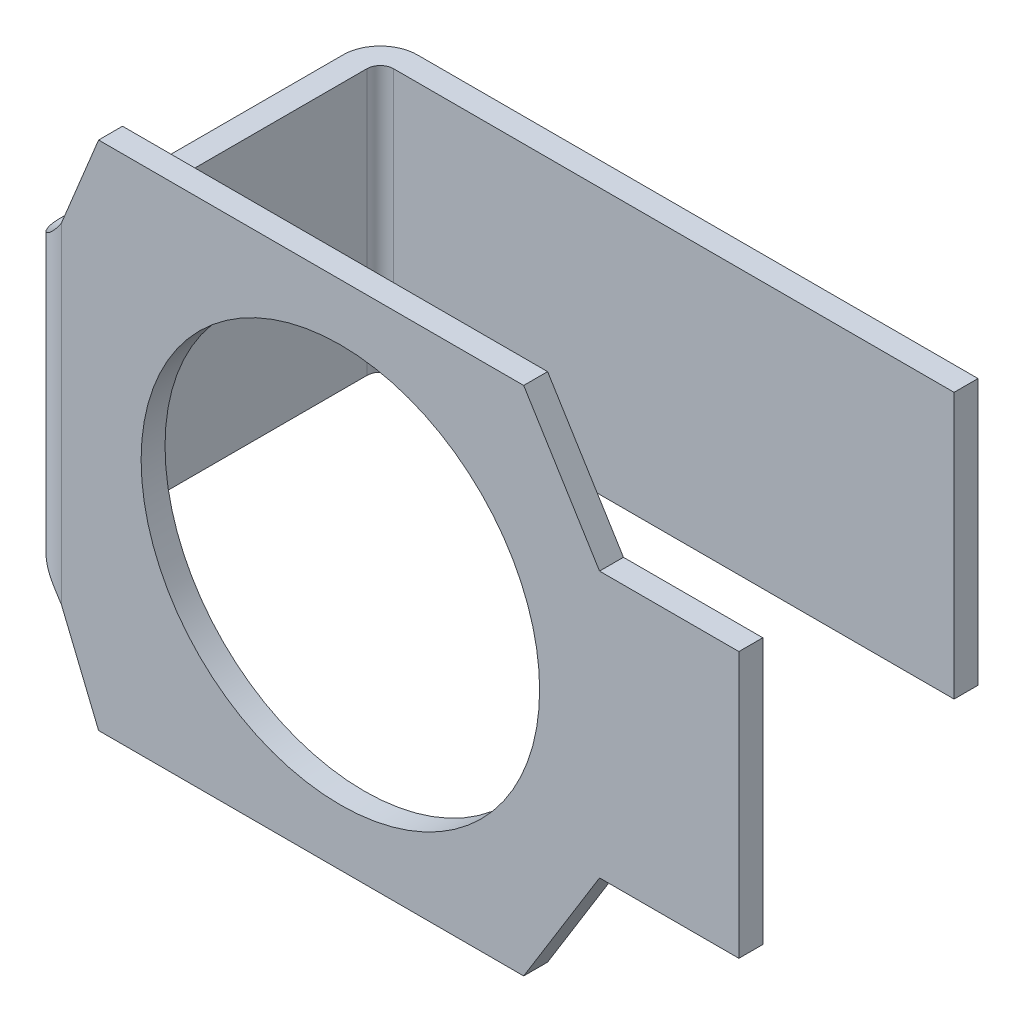
ISO-10303-21;
HEADER;
FILE_DESCRIPTION(('STEP AP214'),'2;1');
FILE_NAME('part.step','',(''),(''),'','','');
FILE_SCHEMA(('AUTOMOTIVE_DESIGN { 1 0 10303 214 1 1 1 1 }'));
ENDSEC;
DATA;
#1=APPLICATION_CONTEXT('core data for automotive mechanical design processes');
#2=APPLICATION_PROTOCOL_DEFINITION('international standard','automotive_design',2000,#1);
#3=PRODUCT_CONTEXT('',#1,'mechanical');
#4=PRODUCT('Part','Part','',(#3));
#5=PRODUCT_RELATED_PRODUCT_CATEGORY('part','',(#4));
#6=PRODUCT_DEFINITION_FORMATION('','',#4);
#7=PRODUCT_DEFINITION_CONTEXT('part definition',#1,'design');
#8=PRODUCT_DEFINITION('design','',#6,#7);
#9=PRODUCT_DEFINITION_SHAPE('','',#8);
#10=(LENGTH_UNIT() NAMED_UNIT(*) SI_UNIT(.MILLI.,.METRE.));
#11=(NAMED_UNIT(*) PLANE_ANGLE_UNIT() SI_UNIT($,.RADIAN.));
#12=(NAMED_UNIT(*) SI_UNIT($,.STERADIAN.) SOLID_ANGLE_UNIT());
#13=UNCERTAINTY_MEASURE_WITH_UNIT(LENGTH_MEASURE(1.E-05),#10,'distance_accuracy_value','');
#14=(GEOMETRIC_REPRESENTATION_CONTEXT(3) GLOBAL_UNCERTAINTY_ASSIGNED_CONTEXT((#13)) GLOBAL_UNIT_ASSIGNED_CONTEXT((#10,
#11,#12)) REPRESENTATION_CONTEXT('',''));
#15=CARTESIAN_POINT('',(0.,0.,0.));
#16=DIRECTION('',(0.,0.,1.));
#17=DIRECTION('',(1.,0.,0.));
#18=AXIS2_PLACEMENT_3D('',#15,#16,#17);
#19=CARTESIAN_POINT('',(0.09,0.,-2.32));
#20=DIRECTION('',(0.,0.,-1.));
#21=DIRECTION('',(-1.,0.,0.));
#22=AXIS2_PLACEMENT_3D('',#19,#20,#21);
#23=PLANE('',#22);
#24=DIRECTION('',(1.,0.,0.));
#25=VECTOR('',#24,1.);
#26=CARTESIAN_POINT('',(2.34,-1.,-2.32));
#27=LINE('',#26,#25);
#28=CARTESIAN_POINT('',(2.34,-1.,-2.32));
#29=VERTEX_POINT('',#28);
#30=CARTESIAN_POINT('',(-1.88,-1.,-2.32));
#31=VERTEX_POINT('',#30);
#32=EDGE_CURVE('E157',#29,#31,#27,.F.);
#33=ORIENTED_EDGE('',*,*,#32,.F.);
#34=DIRECTION('',(0.,1.,0.));
#35=VECTOR('',#34,1.);
#36=CARTESIAN_POINT('',(2.34,0.999999999999999,-2.32));
#37=LINE('',#36,#35);
#38=CARTESIAN_POINT('',(2.34,0.999999999999999,-2.32));
#39=VERTEX_POINT('',#38);
#40=EDGE_CURVE('E176',#39,#29,#37,.F.);
#41=ORIENTED_EDGE('',*,*,#40,.F.);
#42=DIRECTION('',(1.,0.,0.));
#43=VECTOR('',#42,1.);
#44=CARTESIAN_POINT('',(-2.16,0.999999999999999,-2.32));
#45=LINE('',#44,#43);
#46=CARTESIAN_POINT('',(-1.88,0.999999999999999,-2.32));
#47=VERTEX_POINT('',#46);
#48=EDGE_CURVE('E160',#47,#39,#45,.T.);
#49=ORIENTED_EDGE('',*,*,#48,.F.);
#50=DIRECTION('',(0.,-1.,0.));
#51=VECTOR('',#50,1.);
#52=CARTESIAN_POINT('',(-1.88,0.,-2.32));
#53=LINE('',#52,#51);
#54=EDGE_CURVE('E146',#47,#31,#53,.T.);
#55=ORIENTED_EDGE('',*,*,#54,.T.);
#56=EDGE_LOOP('',(#33,#41,#49,#55));
#57=FACE_BOUND('',#56,.T.);
#58=ADVANCED_FACE('F17',(#57),#23,.F.);
#59=CARTESIAN_POINT('',(2.34,0.999999999999999,-2.32));
#60=DIRECTION('',(1.,0.,0.));
#61=DIRECTION('',(0.,0.,-1.));
#62=AXIS2_PLACEMENT_3D('',#59,#60,#61);
#63=PLANE('',#62);
#64=DIRECTION('',(0.,1.,0.));
#65=VECTOR('',#64,1.);
#66=CARTESIAN_POINT('',(2.34,0.,-2.5));
#67=LINE('',#66,#65);
#68=CARTESIAN_POINT('',(2.34,0.999999999999999,-2.5));
#69=VERTEX_POINT('',#68);
#70=CARTESIAN_POINT('',(2.34,-1.,-2.5));
#71=VERTEX_POINT('',#70);
#72=EDGE_CURVE('E385',#69,#71,#67,.F.);
#73=ORIENTED_EDGE('',*,*,#72,.F.);
#74=DIRECTION('',(0.,0.,-1.));
#75=VECTOR('',#74,1.);
#76=CARTESIAN_POINT('',(2.34,0.999999999999999,-2.32));
#77=LINE('',#76,#75);
#78=EDGE_CURVE('E168',#69,#39,#77,.F.);
#79=ORIENTED_EDGE('',*,*,#78,.T.);
#80=ORIENTED_EDGE('',*,*,#40,.T.);
#81=DIRECTION('',(0.,0.,-1.));
#82=VECTOR('',#81,1.);
#83=CARTESIAN_POINT('',(2.34,-1.,-2.32));
#84=LINE('',#83,#82);
#85=EDGE_CURVE('E166',#71,#29,#84,.F.);
#86=ORIENTED_EDGE('',*,*,#85,.F.);
#87=EDGE_LOOP('',(#73,#79,#80,#86));
#88=FACE_BOUND('',#87,.T.);
#89=ADVANCED_FACE('F266',(#88),#63,.T.);
#90=CARTESIAN_POINT('',(-1.88,0.,-2.22));
#91=DIRECTION('',(0.,-1.,0.));
#92=DIRECTION('',(0.,0.,-1.));
#93=AXIS2_PLACEMENT_3D('',#90,#91,#92);
#94=CYLINDRICAL_SURFACE('',#93,0.1);
#95=CARTESIAN_POINT('',(-1.88,0.999999999999999,-2.22));
#96=DIRECTION('',(0.,-1.,0.));
#97=DIRECTION('',(0.,0.,-1.));
#98=AXIS2_PLACEMENT_3D('',#95,#96,#97);
#99=CIRCLE('',#98,0.1);
#100=CARTESIAN_POINT('',(-1.98,1.,-2.22));
#101=VERTEX_POINT('',#100);
#102=EDGE_CURVE('E153',#101,#47,#99,.T.);
#103=ORIENTED_EDGE('',*,*,#102,.F.);
#104=DIRECTION('',(0.,1.,0.));
#105=VECTOR('',#104,1.);
#106=CARTESIAN_POINT('',(-1.98,0.,-2.22));
#107=LINE('',#106,#105);
#108=CARTESIAN_POINT('',(-1.98,-1.,-2.22));
#109=VERTEX_POINT('',#108);
#110=EDGE_CURVE('E148',#109,#101,#107,.T.);
#111=ORIENTED_EDGE('',*,*,#110,.F.);
#112=CARTESIAN_POINT('',(-1.88,-1.,-2.22));
#113=DIRECTION('',(0.,-1.,0.));
#114=DIRECTION('',(0.,0.,-1.));
#115=AXIS2_PLACEMENT_3D('',#112,#113,#114);
#116=CIRCLE('',#115,0.1);
#117=EDGE_CURVE('E24',#31,#109,#116,.F.);
#118=ORIENTED_EDGE('',*,*,#117,.F.);
#119=ORIENTED_EDGE('',*,*,#54,.F.);
#120=EDGE_LOOP('',(#103,#111,#118,#119));
#121=FACE_BOUND('',#120,.T.);
#122=ADVANCED_FACE('F145',(#121),#94,.F.);
#123=CARTESIAN_POINT('',(0.09,0.,-2.5));
#124=DIRECTION('',(0.,0.,-1.));
#125=DIRECTION('',(-1.,0.,0.));
#126=AXIS2_PLACEMENT_3D('',#123,#124,#125);
#127=PLANE('',#126);
#128=ORIENTED_EDGE('',*,*,#72,.T.);
#129=DIRECTION('',(-1.,0.,0.));
#130=VECTOR('',#129,1.);
#131=CARTESIAN_POINT('',(0.09,-1.,-2.5));
#132=LINE('',#131,#130);
#133=CARTESIAN_POINT('',(-1.88,-1.,-2.5));
#134=VERTEX_POINT('',#133);
#135=EDGE_CURVE('E154',#71,#134,#132,.T.);
#136=ORIENTED_EDGE('',*,*,#135,.T.);
#137=DIRECTION('',(0.,-1.,0.));
#138=VECTOR('',#137,1.);
#139=CARTESIAN_POINT('',(-1.88,0.,-2.5));
#140=LINE('',#139,#138);
#141=CARTESIAN_POINT('',(-1.88,0.999999999999999,-2.5));
#142=VERTEX_POINT('',#141);
#143=EDGE_CURVE('E372',#142,#134,#140,.T.);
#144=ORIENTED_EDGE('',*,*,#143,.F.);
#145=DIRECTION('',(-1.,0.,0.));
#146=VECTOR('',#145,1.);
#147=CARTESIAN_POINT('',(0.09,0.999999999999999,-2.5));
#148=LINE('',#147,#146);
#149=EDGE_CURVE('E162',#142,#69,#148,.F.);
#150=ORIENTED_EDGE('',*,*,#149,.T.);
#151=EDGE_LOOP('',(#128,#136,#144,#150));
#152=FACE_BOUND('',#151,.T.);
#153=ADVANCED_FACE('F260',(#152),#127,.T.);
#154=CARTESIAN_POINT('',(-1.98,0.,-1.07));
#155=DIRECTION('',(1.,0.,0.));
#156=DIRECTION('',(0.,0.,-1.));
#157=AXIS2_PLACEMENT_3D('',#154,#155,#156);
#158=PLANE('',#157);
#159=DIRECTION('',(0.,-1.,0.));
#160=VECTOR('',#159,1.);
#161=CARTESIAN_POINT('',(-1.98,0.,-0.1));
#162=LINE('',#161,#160);
#163=CARTESIAN_POINT('',(-1.98,1.,-0.1));
#164=VERTEX_POINT('',#163);
#165=CARTESIAN_POINT('',(-1.98,-1.,-0.0999999999999999));
#166=VERTEX_POINT('',#165);
#167=EDGE_CURVE('E365',#164,#166,#162,.T.);
#168=ORIENTED_EDGE('',*,*,#167,.T.);
#169=DIRECTION('',(0.,0.,-1.));
#170=VECTOR('',#169,1.);
#171=CARTESIAN_POINT('',(-1.98,-1.,-2.32));
#172=LINE('',#171,#170);
#173=EDGE_CURVE('E373',#109,#166,#172,.F.);
#174=ORIENTED_EDGE('',*,*,#173,.F.);
#175=ORIENTED_EDGE('',*,*,#110,.T.);
#176=DIRECTION('',(0.,0.,1.));
#177=VECTOR('',#176,1.);
#178=CARTESIAN_POINT('',(-1.98,1.,0.18));
#179=LINE('',#178,#177);
#180=EDGE_CURVE('E379',#164,#101,#179,.F.);
#181=ORIENTED_EDGE('',*,*,#180,.F.);
#182=EDGE_LOOP('',(#168,#174,#175,#181));
#183=FACE_BOUND('',#182,.T.);
#184=ADVANCED_FACE('F256',(#183),#158,.T.);
#185=CARTESIAN_POINT('',(-1.98,1.,0.18));
#186=DIRECTION('',(0.,1.,0.));
#187=DIRECTION('',(0.,0.,1.));
#188=AXIS2_PLACEMENT_3D('',#185,#186,#187);
#189=PLANE('',#188);
#190=DIRECTION('',(1.,0.,0.));
#191=VECTOR('',#190,1.);
#192=CARTESIAN_POINT('',(-1.98,1.,-0.1));
#193=LINE('',#192,#191);
#194=CARTESIAN_POINT('',(-2.16,1.,-0.1));
#195=VERTEX_POINT('',#194);
#196=EDGE_CURVE('E376',#195,#164,#193,.T.);
#197=ORIENTED_EDGE('',*,*,#196,.T.);
#198=ORIENTED_EDGE('',*,*,#180,.T.);
#199=ORIENTED_EDGE('',*,*,#102,.T.);
#200=ORIENTED_EDGE('',*,*,#48,.T.);
#201=ORIENTED_EDGE('',*,*,#78,.F.);
#202=ORIENTED_EDGE('',*,*,#149,.F.);
#203=CARTESIAN_POINT('',(-1.88,0.999999999999999,-2.22));
#204=DIRECTION('',(0.,-1.,0.));
#205=DIRECTION('',(0.,0.,-1.));
#206=AXIS2_PLACEMENT_3D('',#203,#204,#205);
#207=CIRCLE('',#206,0.28);
#208=CARTESIAN_POINT('',(-2.16,1.,-2.22));
#209=VERTEX_POINT('',#208);
#210=EDGE_CURVE('E238',#209,#142,#207,.T.);
#211=ORIENTED_EDGE('',*,*,#210,.F.);
#212=DIRECTION('',(0.,0.,-1.));
#213=VECTOR('',#212,1.);
#214=CARTESIAN_POINT('',(-2.16,0.999999999999999,-1.07));
#215=LINE('',#214,#213);
#216=EDGE_CURVE('E361',#209,#195,#215,.F.);
#217=ORIENTED_EDGE('',*,*,#216,.T.);
#218=EDGE_LOOP('',(#197,#198,#199,#200,#201,#202,#211,#217));
#219=FACE_BOUND('',#218,.T.);
#220=ADVANCED_FACE('F253',(#219),#189,.T.);
#221=CARTESIAN_POINT('',(-1.98,-1.,-2.32));
#222=DIRECTION('',(0.,-1.,0.));
#223=DIRECTION('',(0.,0.,-1.));
#224=AXIS2_PLACEMENT_3D('',#221,#222,#223);
#225=PLANE('',#224);
#226=DIRECTION('',(1.,0.,0.));
#227=VECTOR('',#226,1.);
#228=CARTESIAN_POINT('',(-1.98,-1.,-0.0999999999999998));
#229=LINE('',#228,#227);
#230=CARTESIAN_POINT('',(-2.16,-1.,-0.0999999999999999));
#231=VERTEX_POINT('',#230);
#232=EDGE_CURVE('E370',#166,#231,#229,.F.);
#233=ORIENTED_EDGE('',*,*,#232,.T.);
#234=DIRECTION('',(0.,0.,-1.));
#235=VECTOR('',#234,1.);
#236=CARTESIAN_POINT('',(-2.16,-1.,-1.07));
#237=LINE('',#236,#235);
#238=CARTESIAN_POINT('',(-2.16,-1.,-2.22));
#239=VERTEX_POINT('',#238);
#240=EDGE_CURVE('E364',#231,#239,#237,.T.);
#241=ORIENTED_EDGE('',*,*,#240,.T.);
#242=CARTESIAN_POINT('',(-1.88,-1.,-2.22));
#243=DIRECTION('',(0.,-1.,0.));
#244=DIRECTION('',(0.,0.,-1.));
#245=AXIS2_PLACEMENT_3D('',#242,#243,#244);
#246=CIRCLE('',#245,0.28);
#247=EDGE_CURVE('E382',#134,#239,#246,.F.);
#248=ORIENTED_EDGE('',*,*,#247,.F.);
#249=ORIENTED_EDGE('',*,*,#135,.F.);
#250=ORIENTED_EDGE('',*,*,#85,.T.);
#251=ORIENTED_EDGE('',*,*,#32,.T.);
#252=ORIENTED_EDGE('',*,*,#117,.T.);
#253=ORIENTED_EDGE('',*,*,#173,.T.);
#254=EDGE_LOOP('',(#233,#241,#248,#249,#250,#251,#252,#253));
#255=FACE_BOUND('',#254,.T.);
#256=ADVANCED_FACE('F164',(#255),#225,.T.);
#257=CARTESIAN_POINT('',(-1.88,0.,-2.22));
#258=DIRECTION('',(0.,-1.,0.));
#259=DIRECTION('',(0.,0.,-1.));
#260=AXIS2_PLACEMENT_3D('',#257,#258,#259);
#261=CYLINDRICAL_SURFACE('',#260,0.28);
#262=DIRECTION('',(0.,1.,0.));
#263=VECTOR('',#262,1.);
#264=CARTESIAN_POINT('',(-2.16,0.,-2.22));
#265=LINE('',#264,#263);
#266=EDGE_CURVE('E233',#239,#209,#265,.T.);
#267=ORIENTED_EDGE('',*,*,#266,.T.);
#268=ORIENTED_EDGE('',*,*,#210,.T.);
#269=ORIENTED_EDGE('',*,*,#143,.T.);
#270=ORIENTED_EDGE('',*,*,#247,.T.);
#271=EDGE_LOOP('',(#267,#268,#269,#270));
#272=FACE_BOUND('',#271,.T.);
#273=ADVANCED_FACE('F245',(#272),#261,.T.);
#274=CARTESIAN_POINT('',(-1.88,0.,-0.1));
#275=DIRECTION('',(0.,-1.,0.));
#276=DIRECTION('',(0.,0.,-1.));
#277=AXIS2_PLACEMENT_3D('',#274,#275,#276);
#278=CYLINDRICAL_SURFACE('',#277,0.1);
#279=ORIENTED_EDGE('',*,*,#167,.F.);
#280=CARTESIAN_POINT('',(-1.98,1.,-0.1));
#281=CARTESIAN_POINT('',(-1.9800048628544,1.00015115372274,-0.0962516361969924));
#282=CARTESIAN_POINT('',(-1.97978914912325,1.0005940781265,-0.0925261912013735));
#283=CARTESIAN_POINT('',(-1.97897292920095,1.00201194494179,-0.0852557648470962));
#284=CARTESIAN_POINT('',(-1.9783759304913,1.0029820259738,-0.0817094532529605));
#285=CARTESIAN_POINT('',(-1.97609588948256,1.00660950143417,-0.0714642954467418));
#286=CARTESIAN_POINT('',(-1.97392294255689,1.00998617177173,-0.0651265754513279));
#287=CARTESIAN_POINT('',(-1.9675928608341,1.02006871245413,-0.0508302509021742));
#288=CARTESIAN_POINT('',(-1.96298899314376,1.02759419321134,-0.0436938411052122));
#289=CARTESIAN_POINT('',(-1.9543276734179,1.04270523193765,-0.0328029244954414));
#290=CARTESIAN_POINT('',(-1.95030413262022,1.05007932532885,-0.0286860541939399));
#291=CARTESIAN_POINT('',(-1.94235258506612,1.06544392239196,-0.0216403200904278));
#292=CARTESIAN_POINT('',(-1.93842489252491,1.07343616767915,-0.018714970035386));
#293=CARTESIAN_POINT('',(-1.93058080893905,1.09023204306656,-0.0136013274961324));
#294=CARTESIAN_POINT('',(-1.92667723576769,1.09905607095524,-0.0114631715074512));
#295=CARTESIAN_POINT('',(-1.91916320496769,1.11697189080199,-0.00789514185944431));
#296=CARTESIAN_POINT('',(-1.91555301338553,1.12606391582857,-0.00646590520463352));
#297=CARTESIAN_POINT('',(-1.9052364447987,1.15366354648299,-0.00295882116322738));
#298=CARTESIAN_POINT('',(-1.89905710608535,1.17246698596538,-0.00166857767005869));
#299=CARTESIAN_POINT('',(-1.89100016756286,1.20006934137743,-0.000576662542914307));
#300=CARTESIAN_POINT('',(-1.88861674135146,1.20872183626193,-0.000346848200923196));
#301=CARTESIAN_POINT('',(-1.88411614937248,1.22604661737994,-5.88824380642145E-05));
#302=CARTESIAN_POINT('',(-1.88199755402879,1.23471851494931,2.32453047594248E-07));
#303=CARTESIAN_POINT('',(-1.88,1.24342105263158,0.));
#304=B_SPLINE_CURVE_WITH_KNOTS('',3,(#280,#281,#282,#283,#284,#285,#286,#287,#288,#289,#290,
#291,#292,#293,#294,#295,#296,#297,#298,#299,#300,#301,#302,#303),.UNSPECIFIED.,.F.,.F.,(4,2,2,
2,2,2,2,2,2,2,2,4),(0.,0.0112191906894548,0.0223366328949989,0.0444786915976039,
0.0779150510509893,0.105878349601292,0.133923523980392,0.163530986584346,0.193165005206567,
0.252526425958963,0.279458001964367,0.306237269447355),.UNSPECIFIED.);
#305=CARTESIAN_POINT('',(-1.88,1.24342105263158,0.));
#306=VERTEX_POINT('',#305);
#307=EDGE_CURVE('E232',#164,#306,#304,.T.);
#308=ORIENTED_EDGE('',*,*,#307,.T.);
#309=DIRECTION('',(0.,1.,0.));
#310=VECTOR('',#309,1.);
#311=CARTESIAN_POINT('',(-1.88,0.,0.));
#312=LINE('',#311,#310);
#313=CARTESIAN_POINT('',(-1.88,-1.24342105263158,0.));
#314=VERTEX_POINT('',#313);
#315=EDGE_CURVE('E354',#306,#314,#312,.F.);
#316=ORIENTED_EDGE('',*,*,#315,.T.);
#317=CARTESIAN_POINT('',(-1.98,-1.,-0.1));
#318=CARTESIAN_POINT('',(-1.9800048628544,-1.00015115372274,-0.0962516361969924));
#319=CARTESIAN_POINT('',(-1.97978914912325,-1.0005940781265,-0.0925261912013735));
#320=CARTESIAN_POINT('',(-1.97897292920095,-1.00201194494179,-0.085255764847096));
#321=CARTESIAN_POINT('',(-1.9783759304913,-1.0029820259738,-0.0817094532529601));
#322=CARTESIAN_POINT('',(-1.97609588948256,-1.00660950143417,-0.071464295446741));
#323=CARTESIAN_POINT('',(-1.97392294255689,-1.00998617177173,-0.0651265754513268));
#324=CARTESIAN_POINT('',(-1.9675928608341,-1.02006871245413,-0.0508302509021739));
#325=CARTESIAN_POINT('',(-1.96298899314376,-1.02759419321134,-0.0436938411052128));
#326=CARTESIAN_POINT('',(-1.9543276734179,-1.04270523193765,-0.0328029244954425));
#327=CARTESIAN_POINT('',(-1.95030413262022,-1.05007932532885,-0.0286860541939411));
#328=CARTESIAN_POINT('',(-1.94235258506612,-1.06544392239195,-0.0216403200904286));
#329=CARTESIAN_POINT('',(-1.93842489252491,-1.07343616767915,-0.0187149700353864));
#330=CARTESIAN_POINT('',(-1.93058080893905,-1.09023204306656,-0.0136013274961323));
#331=CARTESIAN_POINT('',(-1.92667723576769,-1.09905607095524,-0.0114631715074511));
#332=CARTESIAN_POINT('',(-1.91916320496769,-1.11697189080199,-0.00789514185944401));
#333=CARTESIAN_POINT('',(-1.91555301338553,-1.12606391582857,-0.00646590520463315));
#334=CARTESIAN_POINT('',(-1.9052364447987,-1.153663546483,-0.00295882116322685));
#335=CARTESIAN_POINT('',(-1.89905710608535,-1.17246698596538,-0.00166857767005812));
#336=CARTESIAN_POINT('',(-1.89100016756286,-1.20006934137743,-0.00057666254291404));
#337=CARTESIAN_POINT('',(-1.88861674135146,-1.20872183626194,-0.00034684820092307));
#338=CARTESIAN_POINT('',(-1.88411614937248,-1.22604661737994,-5.88824380642704E-05));
#339=CARTESIAN_POINT('',(-1.88199755402879,-1.23471851494932,2.3245304750006E-07));
#340=CARTESIAN_POINT('',(-1.88,-1.24342105263158,0.));
#341=B_SPLINE_CURVE_WITH_KNOTS('',3,(#317,#318,#319,#320,#321,#322,#323,#324,#325,#326,#327,
#328,#329,#330,#331,#332,#333,#334,#335,#336,#337,#338,#339,#340),.UNSPECIFIED.,.F.,.F.,(4,2,2,
2,2,2,2,2,2,2,2,4),(0.,0.0112191906894548,0.0223366328949994,0.0444786915976047,
0.077915051050986,0.105878349601291,0.133923523980393,0.163530986584348,0.19316500520657,
0.252526425958967,0.27945800196437,0.306237269447356),.UNSPECIFIED.);
#342=EDGE_CURVE('E224',#166,#314,#341,.T.);
#343=ORIENTED_EDGE('',*,*,#342,.F.);
#344=EDGE_LOOP('',(#279,#308,#316,#343));
#345=FACE_BOUND('',#344,.T.);
#346=ADVANCED_FACE('F240',(#345),#278,.F.);
#347=CARTESIAN_POINT('',(-2.16,0.,-1.07));
#348=DIRECTION('',(1.,0.,0.));
#349=DIRECTION('',(0.,0.,-1.));
#350=AXIS2_PLACEMENT_3D('',#347,#348,#349);
#351=PLANE('',#350);
#352=ORIENTED_EDGE('',*,*,#240,.F.);
#353=DIRECTION('',(0.,-1.,0.));
#354=VECTOR('',#353,1.);
#355=CARTESIAN_POINT('',(-2.16,0.,-0.1));
#356=LINE('',#355,#354);
#357=EDGE_CURVE('E197',#195,#231,#356,.T.);
#358=ORIENTED_EDGE('',*,*,#357,.F.);
#359=ORIENTED_EDGE('',*,*,#216,.F.);
#360=ORIENTED_EDGE('',*,*,#266,.F.);
#361=EDGE_LOOP('',(#352,#358,#359,#360));
#362=FACE_BOUND('',#361,.T.);
#363=ADVANCED_FACE('F214',(#362),#351,.F.);
#364=CARTESIAN_POINT('',(-1.88,-1.24342105263158,0.1818));
#365=CARTESIAN_POINT('',(-1.88,-1.24342105263158,0.1812));
#366=CARTESIAN_POINT('',(-1.88,-1.24342105263158,0.1806));
#367=CARTESIAN_POINT('',(-1.88,-1.24342105263158,0.18));
#368=CARTESIAN_POINT('',(-1.88,-1.24342105263158,0.12));
#369=CARTESIAN_POINT('',(-1.88,-1.24342105263158,0.06));
#370=CARTESIAN_POINT('',(-1.88,-1.24342105263158,0.));
#371=CARTESIAN_POINT('',(-1.88,-1.24342105263158,-0.00060600000000007));
#372=CARTESIAN_POINT('',(-1.88,-1.24342105263158,-0.00121200000000007));
#373=CARTESIAN_POINT('',(-1.88,-1.24342105263158,-0.00181800000000007));
#374=CARTESIAN_POINT('',(-1.90231744609314,-1.20887509922092,0.181799139719044));
#375=CARTESIAN_POINT('',(-1.90226988652609,-1.20887509922092,0.181199426479363));
#376=CARTESIAN_POINT('',(-1.90222232695903,-1.20887509922092,0.180599713239681));
#377=CARTESIAN_POINT('',(-1.90217476739198,-1.20887509922092,0.18));
#378=CARTESIAN_POINT('',(-1.89741881068639,-1.20887509922092,0.120028676031855));
#379=CARTESIAN_POINT('',(-1.89267551648844,-1.20887509922092,0.059971323968144));
#380=CARTESIAN_POINT('',(-1.88791955978285,-1.20887509922092,0.));
#381=CARTESIAN_POINT('',(-1.88787152462012,-1.20887509922092,-0.000605710372078323));
#382=CARTESIAN_POINT('',(-1.8878234894574,-1.20887509922092,-0.00121142074415658));
#383=CARTESIAN_POINT('',(-1.88777545429467,-1.20887509922092,-0.00181713111623483));
#384=CARTESIAN_POINT('',(-1.95857231834522,-1.14005615364869,0.176959660939102));
#385=CARTESIAN_POINT('',(-1.95840502866096,-1.14005615364869,0.176369942216375));
#386=CARTESIAN_POINT('',(-1.9582377389767,-1.14005615364869,0.175780223493649));
#387=CARTESIAN_POINT('',(-1.95807044929245,-1.14005615364869,0.175190504770922));
#388=CARTESIAN_POINT('',(-1.94134148086692,-1.14005615364869,0.116218632498259));
#389=CARTESIAN_POINT('',(-1.92461127174426,-1.14005615364869,0.057254195405134));
#390=CARTESIAN_POINT('',(-1.90788230331874,-1.14005615364869,-0.001717676867528));
#391=CARTESIAN_POINT('',(-1.90771334073764,-1.14005615364869,-0.00231329277748189));
#392=CARTESIAN_POINT('',(-1.90754437815654,-1.14005615364869,-0.00290890868743577));
#393=CARTESIAN_POINT('',(-1.90737541557544,-1.14005615364869,-0.00350452459738966));
#394=CARTESIAN_POINT('',(-2.04918203175331,-1.06804383051787,0.133260990578889));
#395=CARTESIAN_POINT('',(-2.04882184455051,-1.06804383051787,0.132764124296989));
#396=CARTESIAN_POINT('',(-2.0484616573477,-1.06804383051787,0.132267258015088));
#397=CARTESIAN_POINT('',(-2.04810147014489,-1.06804383051787,0.131770391733187));
#398=CARTESIAN_POINT('',(-2.01208274986422,-1.06804383051787,0.082083763543111));
#399=CARTESIAN_POINT('',(-1.97605495961813,-1.06804383051787,0.032461768094785));
#400=CARTESIAN_POINT('',(-1.94003623933746,-1.06804383051787,-0.01722486009529));
#401=CARTESIAN_POINT('',(-1.93967245026263,-1.06804383051787,-0.0177266950400098));
#402=CARTESIAN_POINT('',(-1.93930866118779,-1.06804383051787,-0.0182285299847295));
#403=CARTESIAN_POINT('',(-1.93894487211296,-1.06804383051787,-0.0187303649294493));
#404=CARTESIAN_POINT('',(-2.13094193164918,-1.01653674329674,0.0448658988904347));
#405=CARTESIAN_POINT('',(-2.13040755453305,-1.01653674329674,0.0445580230117995));
#406=CARTESIAN_POINT('',(-2.12987317741692,-1.01653674329674,0.0442501471331642));
#407=CARTESIAN_POINT('',(-2.12933880030079,-1.01653674329674,0.043942271254529));
#408=CARTESIAN_POINT('',(-2.07590108868777,-1.01653674329674,0.013154683391005));
#409=CARTESIAN_POINT('',(-2.02248728314902,-1.01653674329674,-0.017804458117001));
#410=CARTESIAN_POINT('',(-1.969049571536,-1.01653674329674,-0.048592045980525));
#411=CARTESIAN_POINT('',(-1.96850985064871,-1.01653674329674,-0.0489030006179466));
#412=CARTESIAN_POINT('',(-1.96797012976142,-1.01653674329674,-0.0492139552553682));
#413=CARTESIAN_POINT('',(-1.96743040887412,-1.01653674329674,-0.0495249098927898));
#414=CARTESIAN_POINT('',(-2.16179952562928,-1.00093464754503,-0.0379170061395423));
#415=CARTESIAN_POINT('',(-2.16119968375285,-1.00093464754503,-0.0380503284403745));
#416=CARTESIAN_POINT('',(-2.16059984187643,-1.00093464754503,-0.0381836507412068));
#417=CARTESIAN_POINT('',(-2.16,-1.00093464754503,-0.038316973042039));
#418=CARTESIAN_POINT('',(-2.1000158123574,-1.00093464754503,-0.051649203125262));
#419=CARTESIAN_POINT('',(-2.0399841876426,-1.00093464754503,-0.064638117431791));
#420=CARTESIAN_POINT('',(-1.98,-1.00093464754503,-0.077970347515014));
#421=CARTESIAN_POINT('',(-1.97939415970481,-1.00093464754503,-0.0781050030388546));
#422=CARTESIAN_POINT('',(-1.97878831940962,-1.00093464754503,-0.0782396585626951));
#423=CARTESIAN_POINT('',(-1.97818247911443,-1.00093464754503,-0.0783743140865357));
#424=CARTESIAN_POINT('',(-2.1618,-1.,-0.1));
#425=CARTESIAN_POINT('',(-2.1612,-1.,-0.1));
#426=CARTESIAN_POINT('',(-2.1606,-1.,-0.1));
#427=CARTESIAN_POINT('',(-2.16,-1.,-0.1));
#428=CARTESIAN_POINT('',(-2.1,-1.,-0.1));
#429=CARTESIAN_POINT('',(-2.04,-1.,-0.1));
#430=CARTESIAN_POINT('',(-1.98,-1.,-0.1));
#431=CARTESIAN_POINT('',(-1.979394,-1.,-0.1));
#432=CARTESIAN_POINT('',(-1.978788,-1.,-0.1));
#433=CARTESIAN_POINT('',(-1.978182,-1.,-0.1));
#434=B_SPLINE_SURFACE_WITH_KNOTS('',3,3,((#364,#365,#366,#367,#368,#369,#370,#371,#372,#373),
(#374,#375,#376,#377,#378,#379,#380,#381,#382,#383),(#384,#385,#386,#387,#388,#389,#390,#391,
#392,#393),(#394,#395,#396,#397,#398,#399,#400,#401,#402,#403),(#404,#405,#406,#407,#408,#409,
#410,#411,#412,#413),(#414,#415,#416,#417,#418,#419,#420,#421,#422,#423),(#424,#425,#426,#427,
#428,#429,#430,#431,#432,#433)),.UNSPECIFIED.,.F.,.F.,.F.,(4,1,1,1,4),(4,3,3,4),(0.,
0.285714285714286,0.571428571428571,0.714285714285714,1.),(-0.01,0.,1.,1.0101),.UNSPECIFIED.);
#435=DIRECTION('',(0.,0.,1.));
#436=VECTOR('',#435,1.);
#437=CARTESIAN_POINT('',(-1.88,-1.24342105263158,0.));
#438=LINE('',#437,#436);
#439=CARTESIAN_POINT('',(-1.88000000000202,-1.24342105262844,0.18));
#440=VERTEX_POINT('',#439);
#441=EDGE_CURVE('E196',#440,#314,#438,.F.);
#442=CARTESIAN_POINT('',(-2.16,-1.,-0.1));
#443=CARTESIAN_POINT('',(-2.16001765683244,-1.00020822807471,-0.0857813190602044));
#444=CARTESIAN_POINT('',(-2.15891812215506,-1.00093930808333,-0.0715765691809391));
#445=CARTESIAN_POINT('',(-2.15462245932983,-1.00346993743874,-0.0436128421971718));
#446=CARTESIAN_POINT('',(-2.15143040310573,-1.00526741100248,-0.0298530536811789));
#447=CARTESIAN_POINT('',(-2.14308069604412,-1.00995747628498,-0.00312033951744917));
#448=CARTESIAN_POINT('',(-2.13792031130652,-1.01285159114124,0.0098514624778923));
#449=CARTESIAN_POINT('',(-2.12588312193428,-1.01973974222816,0.0346523221001592));
#450=CARTESIAN_POINT('',(-2.1190063844008,-1.02373373545947,0.0464814243760976));
#451=CARTESIAN_POINT('',(-2.10366468866051,-1.03297804960224,0.0690112189333404));
#452=CARTESIAN_POINT('',(-2.09516308169411,-1.03825833824395,0.0796745708441443));
#453=CARTESIAN_POINT('',(-2.07709146042519,-1.04997655394252,0.0993322796301083));
#454=CARTESIAN_POINT('',(-2.0675207404256,-1.05641524736817,0.108325523554644));
#455=CARTESIAN_POINT('',(-2.04704258921431,-1.07090293183068,0.125132295978356));
#456=CARTESIAN_POINT('',(-2.0360884880066,-1.07903340503744,0.132818101749446));
#457=CARTESIAN_POINT('',(-2.01390697511955,-1.09643050542797,0.146246227400303));
#458=CARTESIAN_POINT('',(-2.0026794884555,-1.10569744720311,0.151988007483193));
#459=CARTESIAN_POINT('',(-1.9786604637326,-1.12679489073437,0.162416500635631));
#460=CARTESIAN_POINT('',(-1.96589373008003,-1.13880049766875,0.166805461010564));
#461=CARTESIAN_POINT('',(-1.94118120142519,-1.16415841468406,0.173536066337436));
#462=CARTESIAN_POINT('',(-1.92923606021969,-1.17751177688568,0.175876097796018));
#463=CARTESIAN_POINT('',(-1.91109120289409,-1.19971413895276,0.178352321734448));
#464=CARTESIAN_POINT('',(-1.90451582016611,-1.20821010775305,0.178996597961073));
#465=CARTESIAN_POINT('',(-1.89186948361317,-1.22555196625265,0.179820106468258));
#466=CARTESIAN_POINT('',(-1.88579706232269,-1.23439671819739,0.180000741335178));
#467=CARTESIAN_POINT('',(-1.88000000000403,-1.2434210526253,0.18));
#468=B_SPLINE_CURVE_WITH_KNOTS('',3,(#442,#443,#444,#445,#446,#447,#448,#449,#450,#451,#452,
#453,#454,#455,#456,#457,#458,#459,#460,#461,#462,#463,#464,#465,#466,#467),.UNSPECIFIED.,.F.,
.F.,(4,2,2,2,2,2,2,2,2,2,2,2,4),(0.,0.0425989543608762,0.0851152587568371,0.127690832274285,
0.170264741551461,0.213945700358224,0.257655664268645,0.304444575068933,0.351246467093966,
0.405240928016248,0.45927787042876,0.491541527034011,0.523707465462562),.UNSPECIFIED.);
#469=EDGE_CURVE('E188',#231,#440,#468,.T.);
#470=ORIENTED_EDGE('',*,*,#441,.F.);
#471=ORIENTED_EDGE('',*,*,#469,.F.);
#472=ORIENTED_EDGE('',*,*,#232,.F.);
#473=ORIENTED_EDGE('',*,*,#342,.T.);
#474=EDGE_LOOP('',(#470,#471,#472,#473));
#475=FACE_BOUND('',#474,.T.);
#476=ADVANCED_FACE('F208',(#475),#434,.T.);
#477=CARTESIAN_POINT('',(-1.88,1.24342105263158,0.1818));
#478=CARTESIAN_POINT('',(-1.88,1.24342105263158,0.1812));
#479=CARTESIAN_POINT('',(-1.88,1.24342105263158,0.1806));
#480=CARTESIAN_POINT('',(-1.88,1.24342105263158,0.18));
#481=CARTESIAN_POINT('',(-1.88,1.24342105263158,0.12));
#482=CARTESIAN_POINT('',(-1.88,1.24342105263158,0.06));
#483=CARTESIAN_POINT('',(-1.88,1.24342105263158,0.));
#484=CARTESIAN_POINT('',(-1.88,1.24342105263158,-0.00060600000000007));
#485=CARTESIAN_POINT('',(-1.88,1.24342105263158,-0.00121200000000007));
#486=CARTESIAN_POINT('',(-1.88,1.24342105263158,-0.00181800000000007));
#487=CARTESIAN_POINT('',(-1.90231744609314,1.20887509922092,0.181799139719044));
#488=CARTESIAN_POINT('',(-1.90226988652609,1.20887509922092,0.181199426479363));
#489=CARTESIAN_POINT('',(-1.90222232695903,1.20887509922092,0.180599713239681));
#490=CARTESIAN_POINT('',(-1.90217476739198,1.20887509922092,0.18));
#491=CARTESIAN_POINT('',(-1.89741881068639,1.20887509922092,0.120028676031855));
#492=CARTESIAN_POINT('',(-1.89267551648843,1.20887509922092,0.059971323968144));
#493=CARTESIAN_POINT('',(-1.88791955978285,1.20887509922092,0.));
#494=CARTESIAN_POINT('',(-1.88787152462012,1.20887509922092,-0.000605710372078321));
#495=CARTESIAN_POINT('',(-1.8878234894574,1.20887509922092,-0.00121142074415658));
#496=CARTESIAN_POINT('',(-1.88777545429467,1.20887509922092,-0.00181713111623483));
#497=CARTESIAN_POINT('',(-1.95857231834521,1.14005615364869,0.176959660939101));
#498=CARTESIAN_POINT('',(-1.95840502866096,1.14005615364869,0.176369942216374));
#499=CARTESIAN_POINT('',(-1.9582377389767,1.14005615364869,0.175780223493648));
#500=CARTESIAN_POINT('',(-1.95807044929245,1.14005615364869,0.175190504770921));
#501=CARTESIAN_POINT('',(-1.94134148086692,1.14005615364868,0.116218632498259));
#502=CARTESIAN_POINT('',(-1.92461127174426,1.14005615364869,0.057254195405134));
#503=CARTESIAN_POINT('',(-1.90788230331874,1.14005615364869,-0.001717676867528));
#504=CARTESIAN_POINT('',(-1.90771334073764,1.14005615364869,-0.00231329277748189));
#505=CARTESIAN_POINT('',(-1.90754437815654,1.14005615364869,-0.00290890868743577));
#506=CARTESIAN_POINT('',(-1.90737541557544,1.14005615364869,-0.00350452459738966));
#507=CARTESIAN_POINT('',(-2.04918203175331,1.06804383051787,0.133260990578889));
#508=CARTESIAN_POINT('',(-2.04882184455051,1.06804383051787,0.132764124296989));
#509=CARTESIAN_POINT('',(-2.0484616573477,1.06804383051787,0.132267258015088));
#510=CARTESIAN_POINT('',(-2.04810147014489,1.06804383051787,0.131770391733187));
#511=CARTESIAN_POINT('',(-2.01208274986422,1.06804383051787,0.082083763543112));
#512=CARTESIAN_POINT('',(-1.97605495961813,1.06804383051787,0.032461768094785));
#513=CARTESIAN_POINT('',(-1.94003623933746,1.06804383051787,-0.01722486009529));
#514=CARTESIAN_POINT('',(-1.93967245026263,1.06804383051787,-0.0177266950400098));
#515=CARTESIAN_POINT('',(-1.93930866118779,1.06804383051787,-0.0182285299847295));
#516=CARTESIAN_POINT('',(-1.93894487211296,1.06804383051787,-0.0187303649294493));
#517=CARTESIAN_POINT('',(-2.13094193164918,1.01653674329674,0.0448658988904347));
#518=CARTESIAN_POINT('',(-2.13040755453305,1.01653674329674,0.0445580230117995));
#519=CARTESIAN_POINT('',(-2.12987317741692,1.01653674329674,0.0442501471331642));
#520=CARTESIAN_POINT('',(-2.12933880030079,1.01653674329674,0.043942271254529));
#521=CARTESIAN_POINT('',(-2.07590108868777,1.01653674329674,0.013154683391005));
#522=CARTESIAN_POINT('',(-2.02248728314902,1.01653674329674,-0.017804458117001));
#523=CARTESIAN_POINT('',(-1.969049571536,1.01653674329674,-0.048592045980525));
#524=CARTESIAN_POINT('',(-1.96850985064871,1.01653674329674,-0.0489030006179466));
#525=CARTESIAN_POINT('',(-1.96797012976142,1.01653674329674,-0.0492139552553682));
#526=CARTESIAN_POINT('',(-1.96743040887412,1.01653674329674,-0.0495249098927898));
#527=CARTESIAN_POINT('',(-2.16179952562928,1.00093464754503,-0.0379170061395423));
#528=CARTESIAN_POINT('',(-2.16119968375285,1.00093464754503,-0.0380503284403745));
#529=CARTESIAN_POINT('',(-2.16059984187643,1.00093464754503,-0.0381836507412068));
#530=CARTESIAN_POINT('',(-2.16,1.00093464754503,-0.038316973042039));
#531=CARTESIAN_POINT('',(-2.1000158123574,1.00093464754503,-0.051649203125262));
#532=CARTESIAN_POINT('',(-2.0399841876426,1.00093464754503,-0.064638117431791));
#533=CARTESIAN_POINT('',(-1.98,1.00093464754503,-0.077970347515014));
#534=CARTESIAN_POINT('',(-1.97939415970481,1.00093464754503,-0.0781050030388546));
#535=CARTESIAN_POINT('',(-1.97878831940962,1.00093464754503,-0.0782396585626951));
#536=CARTESIAN_POINT('',(-1.97818247911443,1.00093464754503,-0.0783743140865357));
#537=CARTESIAN_POINT('',(-2.1618,1.,-0.099999999999999));
#538=CARTESIAN_POINT('',(-2.1612,1.,-0.099999999999999));
#539=CARTESIAN_POINT('',(-2.1606,1.,-0.099999999999999));
#540=CARTESIAN_POINT('',(-2.16,1.,-0.099999999999999));
#541=CARTESIAN_POINT('',(-2.1,1.,-0.1));
#542=CARTESIAN_POINT('',(-2.04,1.,-0.1));
#543=CARTESIAN_POINT('',(-1.98,1.,-0.1));
#544=CARTESIAN_POINT('',(-1.979394,1.,-0.1));
#545=CARTESIAN_POINT('',(-1.978788,1.,-0.1));
#546=CARTESIAN_POINT('',(-1.978182,1.,-0.1));
#547=B_SPLINE_SURFACE_WITH_KNOTS('',3,3,((#477,#478,#479,#480,#481,#482,#483,#484,#485,#486),
(#487,#488,#489,#490,#491,#492,#493,#494,#495,#496),(#497,#498,#499,#500,#501,#502,#503,#504,
#505,#506),(#507,#508,#509,#510,#511,#512,#513,#514,#515,#516),(#517,#518,#519,#520,#521,#522,
#523,#524,#525,#526),(#527,#528,#529,#530,#531,#532,#533,#534,#535,#536),(#537,#538,#539,#540,
#541,#542,#543,#544,#545,#546)),.UNSPECIFIED.,.F.,.F.,.F.,(4,1,1,1,4),(4,3,3,4),(0.,
0.285714285714286,0.571428571428571,0.714285714285714,1.),(-0.01,0.,1.,1.0101),.UNSPECIFIED.);
#548=DIRECTION('',(0.,0.,1.));
#549=VECTOR('',#548,1.);
#550=CARTESIAN_POINT('',(-1.88,1.24342105263158,0.));
#551=LINE('',#550,#549);
#552=CARTESIAN_POINT('',(-1.88,1.24342105263158,0.18));
#553=VERTEX_POINT('',#552);
#554=EDGE_CURVE('E417',#306,#553,#551,.T.);
#555=CARTESIAN_POINT('',(-1.88,1.24342105263158,0.18));
#556=CARTESIAN_POINT('',(-1.89207269592768,1.22463053876369,0.180006525588204));
#557=CARTESIAN_POINT('',(-1.9053876262493,1.20653934871837,0.179215447988258));
#558=CARTESIAN_POINT('',(-1.93386364291224,1.17202332027637,0.175148369115915));
#559=CARTESIAN_POINT('',(-1.94903469297885,1.1556084279546,0.171858414608219));
#560=CARTESIAN_POINT('',(-1.97765571638775,1.12764546960486,0.162766044215412));
#561=CARTESIAN_POINT('',(-1.99093544331105,1.11575012982244,0.157510984838075));
#562=CARTESIAN_POINT('',(-2.0174605130917,1.09347548475657,0.144384868672041));
#563=CARTESIAN_POINT('',(-2.03070587820575,1.08309423078858,0.136517217918441));
#564=CARTESIAN_POINT('',(-2.05658315930016,1.06396548233919,0.117885569732737));
#565=CARTESIAN_POINT('',(-2.06920867961802,1.0552331078842,0.107096786333059));
#566=CARTESIAN_POINT('',(-2.09284377453974,1.03966698046151,0.082715764274105));
#567=CARTESIAN_POINT('',(-2.10385394118621,1.03283253106202,0.0691245571452195));
#568=CARTESIAN_POINT('',(-2.1219789050756,1.02197790424932,0.0416908617223816));
#569=CARTESIAN_POINT('',(-2.12942727997454,1.01769306915867,0.0281719932159443));
#570=CARTESIAN_POINT('',(-2.14207616370991,1.01050755456206,-0.000215357170602362));
#571=CARTESIAN_POINT('',(-2.14727865758142,1.00760565250585,-0.0150826331280499));
#572=CARTESIAN_POINT('',(-2.15410360565343,1.00375581741839,-0.0416619353876489));
#573=CARTESIAN_POINT('',(-2.15630615259203,1.00249552738806,-0.0531841668973408));
#574=CARTESIAN_POINT('',(-2.15925755930443,1.0007053666273,-0.0764669756333659));
#575=CARTESIAN_POINT('',(-2.16000664279305,1.00017538349281,-0.0882275158979736));
#576=CARTESIAN_POINT('',(-2.16,1.00000000000016,-0.0999999999893945));
#577=B_SPLINE_CURVE_WITH_KNOTS('',3,(#555,#556,#557,#558,#559,#560,#561,#562,#563,#564,#565,
#566,#567,#568,#569,#570,#571,#572,#573,#574,#575,#576),.UNSPECIFIED.,.F.,.F.,(4,2,2,2,2,2,2,2,
2,2,4),(0.,0.0670880578224122,0.134553501409699,0.190085270775556,0.245544925763713,
0.301490763501713,0.357416045054831,0.405213122377623,0.452967867046112,0.488253013218075,
0.52353272792464),.UNSPECIFIED.);
#578=EDGE_CURVE('E198',#553,#195,#577,.T.);
#579=ORIENTED_EDGE('',*,*,#554,.F.);
#580=ORIENTED_EDGE('',*,*,#307,.F.);
#581=ORIENTED_EDGE('',*,*,#196,.F.);
#582=ORIENTED_EDGE('',*,*,#578,.F.);
#583=EDGE_LOOP('',(#579,#580,#581,#582));
#584=FACE_BOUND('',#583,.T.);
#585=ADVANCED_FACE('F19',(#584),#547,.F.);
#586=CARTESIAN_POINT('',(0.519092481371663,0.,0.));
#587=DIRECTION('',(0.,0.,1.));
#588=DIRECTION('',(1.,0.,0.));
#589=AXIS2_PLACEMENT_3D('',#586,#587,#588);
#590=PLANE('',#589);
#591=CARTESIAN_POINT('',(0.22,0.,0.));
#592=DIRECTION('',(0.,0.,1.));
#593=DIRECTION('',(1.,0.,0.));
#594=AXIS2_PLACEMENT_3D('',#591,#592,#593);
#595=CIRCLE('',#594,1.5);
#596=CARTESIAN_POINT('',(1.72,0.,0.));
#597=VERTEX_POINT('',#596);
#598=EDGE_CURVE('E183',#597,#597,#595,.T.);
#599=ORIENTED_EDGE('',*,*,#598,.T.);
#600=EDGE_LOOP('',(#599));
#601=FACE_BOUND('',#600,.T.);
#602=DIRECTION('',(-0.37999525008906,-0.924988437716793,0.));
#603=VECTOR('',#602,1.);
#604=CARTESIAN_POINT('',(-1.6,1.925,0.));
#605=LINE('',#604,#603);
#606=CARTESIAN_POINT('',(-1.6,1.925,0.));
#607=VERTEX_POINT('',#606);
#608=EDGE_CURVE('E187',#607,#306,#605,.T.);
#609=ORIENTED_EDGE('',*,*,#608,.F.);
#610=DIRECTION('',(1.,0.,0.));
#611=VECTOR('',#610,1.);
#612=CARTESIAN_POINT('',(1.6,1.925,0.));
#613=LINE('',#612,#611);
#614=CARTESIAN_POINT('',(1.6,1.925,0.));
#615=VERTEX_POINT('',#614);
#616=EDGE_CURVE('E433',#615,#607,#613,.F.);
#617=ORIENTED_EDGE('',*,*,#616,.F.);
#618=DIRECTION('',(-0.525269203792617,0.85093611014404,0.));
#619=VECTOR('',#618,1.);
#620=CARTESIAN_POINT('',(2.17098765432099,1.,0.));
#621=LINE('',#620,#619);
#622=CARTESIAN_POINT('',(2.17098765432099,1.,0.));
#623=VERTEX_POINT('',#622);
#624=EDGE_CURVE('E440',#623,#615,#621,.T.);
#625=ORIENTED_EDGE('',*,*,#624,.F.);
#626=DIRECTION('',(1.,0.,0.));
#627=VECTOR('',#626,1.);
#628=CARTESIAN_POINT('',(3.22,1.,0.));
#629=LINE('',#628,#627);
#630=CARTESIAN_POINT('',(3.22,1.,0.));
#631=VERTEX_POINT('',#630);
#632=EDGE_CURVE('E446',#631,#623,#629,.F.);
#633=ORIENTED_EDGE('',*,*,#632,.F.);
#634=DIRECTION('',(0.,1.,0.));
#635=VECTOR('',#634,1.);
#636=CARTESIAN_POINT('',(3.22,-1.,0.));
#637=LINE('',#636,#635);
#638=CARTESIAN_POINT('',(3.22,-1.,0.));
#639=VERTEX_POINT('',#638);
#640=EDGE_CURVE('E452',#639,#631,#637,.T.);
#641=ORIENTED_EDGE('',*,*,#640,.F.);
#642=DIRECTION('',(1.,0.,0.));
#643=VECTOR('',#642,1.);
#644=CARTESIAN_POINT('',(2.17098765432099,-1.,0.));
#645=LINE('',#644,#643);
#646=CARTESIAN_POINT('',(2.17098765432099,-1.,0.));
#647=VERTEX_POINT('',#646);
#648=EDGE_CURVE('E458',#647,#639,#645,.T.);
#649=ORIENTED_EDGE('',*,*,#648,.F.);
#650=DIRECTION('',(0.525269203792618,0.85093611014404,0.));
#651=VECTOR('',#650,1.);
#652=CARTESIAN_POINT('',(1.6,-1.925,0.));
#653=LINE('',#652,#651);
#654=CARTESIAN_POINT('',(1.6,-1.925,0.));
#655=VERTEX_POINT('',#654);
#656=EDGE_CURVE('E336',#655,#647,#653,.T.);
#657=ORIENTED_EDGE('',*,*,#656,.F.);
#658=DIRECTION('',(1.,0.,0.));
#659=VECTOR('',#658,1.);
#660=CARTESIAN_POINT('',(-1.6,-1.925,0.));
#661=LINE('',#660,#659);
#662=CARTESIAN_POINT('',(-1.6,-1.925,0.));
#663=VERTEX_POINT('',#662);
#664=EDGE_CURVE('E337',#663,#655,#661,.T.);
#665=ORIENTED_EDGE('',*,*,#664,.F.);
#666=DIRECTION('',(0.379995250089061,-0.924988437716792,0.));
#667=VECTOR('',#666,1.);
#668=CARTESIAN_POINT('',(-1.98,-1.,0.));
#669=LINE('',#668,#667);
#670=EDGE_CURVE('E334',#314,#663,#669,.T.);
#671=ORIENTED_EDGE('',*,*,#670,.F.);
#672=ORIENTED_EDGE('',*,*,#315,.F.);
#673=EDGE_LOOP('',(#609,#617,#625,#633,#641,#649,#657,#665,#671,#672));
#674=FACE_BOUND('',#673,.T.);
#675=ADVANCED_FACE('F322',(#601,#674),#590,.F.);
#676=CARTESIAN_POINT('',(-1.88,0.,-0.1));
#677=DIRECTION('',(0.,-1.,0.));
#678=DIRECTION('',(0.,0.,-1.));
#679=AXIS2_PLACEMENT_3D('',#676,#677,#678);
#680=CYLINDRICAL_SURFACE('',#679,0.28);
#681=ORIENTED_EDGE('',*,*,#469,.T.);
#682=DIRECTION('',(0.,1.,0.));
#683=VECTOR('',#682,1.);
#684=CARTESIAN_POINT('',(-1.88,0.,0.18));
#685=LINE('',#684,#683);
#686=EDGE_CURVE('E186',#553,#440,#685,.F.);
#687=ORIENTED_EDGE('',*,*,#686,.F.);
#688=ORIENTED_EDGE('',*,*,#578,.T.);
#689=ORIENTED_EDGE('',*,*,#357,.T.);
#690=EDGE_LOOP('',(#681,#687,#688,#689));
#691=FACE_BOUND('',#690,.T.);
#692=ADVANCED_FACE('F204',(#691),#680,.T.);
#693=CARTESIAN_POINT('',(-1.98,-1.,0.));
#694=DIRECTION('',(-0.924988437716792,-0.379995250089061,0.));
#695=DIRECTION('',(0.379995250089061,-0.924988437716792,0.));
#696=AXIS2_PLACEMENT_3D('',#693,#694,#695);
#697=PLANE('',#696);
#698=DIRECTION('',(0.,0.,-1.));
#699=VECTOR('',#698,1.);
#700=CARTESIAN_POINT('',(-1.6,-1.925,0.));
#701=LINE('',#700,#699);
#702=CARTESIAN_POINT('',(-1.6,-1.925,0.18));
#703=VERTEX_POINT('',#702);
#704=EDGE_CURVE('E327',#703,#663,#701,.T.);
#705=ORIENTED_EDGE('',*,*,#704,.F.);
#706=DIRECTION('',(0.37999525008906,-0.924988437716792,0.));
#707=VECTOR('',#706,1.);
#708=CARTESIAN_POINT('',(-1.88,-1.24342105263158,0.18));
#709=LINE('',#708,#707);
#710=EDGE_CURVE('E331',#440,#703,#709,.T.);
#711=ORIENTED_EDGE('',*,*,#710,.F.);
#712=ORIENTED_EDGE('',*,*,#441,.T.);
#713=ORIENTED_EDGE('',*,*,#670,.T.);
#714=EDGE_LOOP('',(#705,#711,#712,#713));
#715=FACE_BOUND('',#714,.T.);
#716=ADVANCED_FACE('F315',(#715),#697,.T.);
#717=CARTESIAN_POINT('',(-1.6,-1.925,0.));
#718=DIRECTION('',(0.,-1.,0.));
#719=DIRECTION('',(0.,0.,-1.));
#720=AXIS2_PLACEMENT_3D('',#717,#718,#719);
#721=PLANE('',#720);
#722=DIRECTION('',(1.,0.,0.));
#723=VECTOR('',#722,1.);
#724=CARTESIAN_POINT('',(0.519092481371663,-1.925,0.18));
#725=LINE('',#724,#723);
#726=CARTESIAN_POINT('',(1.6,-1.925,0.18));
#727=VERTEX_POINT('',#726);
#728=EDGE_CURVE('E340',#703,#727,#725,.T.);
#729=ORIENTED_EDGE('',*,*,#728,.F.);
#730=ORIENTED_EDGE('',*,*,#704,.T.);
#731=ORIENTED_EDGE('',*,*,#664,.T.);
#732=DIRECTION('',(0.,0.,1.));
#733=VECTOR('',#732,1.);
#734=CARTESIAN_POINT('',(1.6,-1.925,0.));
#735=LINE('',#734,#733);
#736=EDGE_CURVE('E342',#727,#655,#735,.F.);
#737=ORIENTED_EDGE('',*,*,#736,.F.);
#738=EDGE_LOOP('',(#729,#730,#731,#737));
#739=FACE_BOUND('',#738,.T.);
#740=ADVANCED_FACE('F312',(#739),#721,.T.);
#741=CARTESIAN_POINT('',(1.6,-1.925,0.));
#742=DIRECTION('',(0.85093611014404,-0.525269203792618,0.));
#743=DIRECTION('',(0.525269203792618,0.85093611014404,0.));
#744=AXIS2_PLACEMENT_3D('',#741,#742,#743);
#745=PLANE('',#744);
#746=DIRECTION('',(0.525269203792617,0.85093611014404,0.));
#747=VECTOR('',#746,1.);
#748=CARTESIAN_POINT('',(1.6,-1.925,0.18));
#749=LINE('',#748,#747);
#750=CARTESIAN_POINT('',(2.17098765432099,-1.,0.18));
#751=VERTEX_POINT('',#750);
#752=EDGE_CURVE('E345',#727,#751,#749,.T.);
#753=ORIENTED_EDGE('',*,*,#752,.F.);
#754=ORIENTED_EDGE('',*,*,#736,.T.);
#755=ORIENTED_EDGE('',*,*,#656,.T.);
#756=DIRECTION('',(0.,0.,-1.));
#757=VECTOR('',#756,1.);
#758=CARTESIAN_POINT('',(2.17098765432099,-1.,0.));
#759=LINE('',#758,#757);
#760=EDGE_CURVE('E455',#751,#647,#759,.T.);
#761=ORIENTED_EDGE('',*,*,#760,.F.);
#762=EDGE_LOOP('',(#753,#754,#755,#761));
#763=FACE_BOUND('',#762,.T.);
#764=ADVANCED_FACE('F308',(#763),#745,.T.);
#765=CARTESIAN_POINT('',(2.17098765432099,-1.,0.));
#766=DIRECTION('',(0.,-1.,0.));
#767=DIRECTION('',(0.,0.,-1.));
#768=AXIS2_PLACEMENT_3D('',#765,#766,#767);
#769=PLANE('',#768);
#770=DIRECTION('',(1.,0.,0.));
#771=VECTOR('',#770,1.);
#772=CARTESIAN_POINT('',(0.519092481371663,-1.,0.18));
#773=LINE('',#772,#771);
#774=CARTESIAN_POINT('',(3.22,-1.,0.18));
#775=VERTEX_POINT('',#774);
#776=EDGE_CURVE('E463',#751,#775,#773,.T.);
#777=ORIENTED_EDGE('',*,*,#776,.F.);
#778=ORIENTED_EDGE('',*,*,#760,.T.);
#779=ORIENTED_EDGE('',*,*,#648,.T.);
#780=DIRECTION('',(0.,0.,-1.));
#781=VECTOR('',#780,1.);
#782=CARTESIAN_POINT('',(3.22,-1.,0.));
#783=LINE('',#782,#781);
#784=EDGE_CURVE('E449',#775,#639,#783,.T.);
#785=ORIENTED_EDGE('',*,*,#784,.F.);
#786=EDGE_LOOP('',(#777,#778,#779,#785));
#787=FACE_BOUND('',#786,.T.);
#788=ADVANCED_FACE('F304',(#787),#769,.T.);
#789=CARTESIAN_POINT('',(3.22,-1.,0.));
#790=DIRECTION('',(1.,0.,0.));
#791=DIRECTION('',(0.,0.,-1.));
#792=AXIS2_PLACEMENT_3D('',#789,#790,#791);
#793=PLANE('',#792);
#794=DIRECTION('',(0.,1.,0.));
#795=VECTOR('',#794,1.);
#796=CARTESIAN_POINT('',(3.22,0.,0.18));
#797=LINE('',#796,#795);
#798=CARTESIAN_POINT('',(3.22,1.,0.18));
#799=VERTEX_POINT('',#798);
#800=EDGE_CURVE('E466',#775,#799,#797,.T.);
#801=ORIENTED_EDGE('',*,*,#800,.F.);
#802=ORIENTED_EDGE('',*,*,#784,.T.);
#803=ORIENTED_EDGE('',*,*,#640,.T.);
#804=DIRECTION('',(0.,0.,1.));
#805=VECTOR('',#804,1.);
#806=CARTESIAN_POINT('',(3.22,1.,0.));
#807=LINE('',#806,#805);
#808=EDGE_CURVE('E443',#799,#631,#807,.F.);
#809=ORIENTED_EDGE('',*,*,#808,.F.);
#810=EDGE_LOOP('',(#801,#802,#803,#809));
#811=FACE_BOUND('',#810,.T.);
#812=ADVANCED_FACE('F300',(#811),#793,.T.);
#813=CARTESIAN_POINT('',(3.22,1.,0.));
#814=DIRECTION('',(0.,1.,0.));
#815=DIRECTION('',(0.,0.,1.));
#816=AXIS2_PLACEMENT_3D('',#813,#814,#815);
#817=PLANE('',#816);
#818=DIRECTION('',(1.,0.,0.));
#819=VECTOR('',#818,1.);
#820=CARTESIAN_POINT('',(0.519092481371663,1.,0.18));
#821=LINE('',#820,#819);
#822=CARTESIAN_POINT('',(2.17098765432099,1.,0.18));
#823=VERTEX_POINT('',#822);
#824=EDGE_CURVE('E471',#799,#823,#821,.F.);
#825=ORIENTED_EDGE('',*,*,#824,.F.);
#826=ORIENTED_EDGE('',*,*,#808,.T.);
#827=ORIENTED_EDGE('',*,*,#632,.T.);
#828=DIRECTION('',(0.,0.,1.));
#829=VECTOR('',#828,1.);
#830=CARTESIAN_POINT('',(2.17098765432099,1.,0.));
#831=LINE('',#830,#829);
#832=EDGE_CURVE('E435',#823,#623,#831,.F.);
#833=ORIENTED_EDGE('',*,*,#832,.F.);
#834=EDGE_LOOP('',(#825,#826,#827,#833));
#835=FACE_BOUND('',#834,.T.);
#836=ADVANCED_FACE('F296',(#835),#817,.T.);
#837=CARTESIAN_POINT('',(2.17098765432099,1.,0.));
#838=DIRECTION('',(0.85093611014404,0.525269203792617,0.));
#839=DIRECTION('',(-0.525269203792617,0.85093611014404,0.));
#840=AXIS2_PLACEMENT_3D('',#837,#838,#839);
#841=PLANE('',#840);
#842=DIRECTION('',(-0.525269203792617,0.85093611014404,0.));
#843=VECTOR('',#842,1.);
#844=CARTESIAN_POINT('',(2.17098765432099,1.,0.18));
#845=LINE('',#844,#843);
#846=CARTESIAN_POINT('',(1.6,1.925,0.18));
#847=VERTEX_POINT('',#846);
#848=EDGE_CURVE('E474',#823,#847,#845,.T.);
#849=ORIENTED_EDGE('',*,*,#848,.F.);
#850=ORIENTED_EDGE('',*,*,#832,.T.);
#851=ORIENTED_EDGE('',*,*,#624,.T.);
#852=DIRECTION('',(0.,0.,1.));
#853=VECTOR('',#852,1.);
#854=CARTESIAN_POINT('',(1.6,1.925,0.));
#855=LINE('',#854,#853);
#856=EDGE_CURVE('E429',#847,#615,#855,.F.);
#857=ORIENTED_EDGE('',*,*,#856,.F.);
#858=EDGE_LOOP('',(#849,#850,#851,#857));
#859=FACE_BOUND('',#858,.T.);
#860=ADVANCED_FACE('F293',(#859),#841,.T.);
#861=CARTESIAN_POINT('',(1.6,1.925,0.));
#862=DIRECTION('',(0.,1.,0.));
#863=DIRECTION('',(0.,0.,1.));
#864=AXIS2_PLACEMENT_3D('',#861,#862,#863);
#865=PLANE('',#864);
#866=DIRECTION('',(1.,0.,0.));
#867=VECTOR('',#866,1.);
#868=CARTESIAN_POINT('',(0.519092481371663,1.925,0.18));
#869=LINE('',#868,#867);
#870=CARTESIAN_POINT('',(-1.6,1.925,0.18));
#871=VERTEX_POINT('',#870);
#872=EDGE_CURVE('E477',#847,#871,#869,.F.);
#873=ORIENTED_EDGE('',*,*,#872,.F.);
#874=ORIENTED_EDGE('',*,*,#856,.T.);
#875=ORIENTED_EDGE('',*,*,#616,.T.);
#876=DIRECTION('',(0.,0.,1.));
#877=VECTOR('',#876,1.);
#878=CARTESIAN_POINT('',(-1.6,1.925,0.));
#879=LINE('',#878,#877);
#880=EDGE_CURVE('E39',#871,#607,#879,.F.);
#881=ORIENTED_EDGE('',*,*,#880,.F.);
#882=EDGE_LOOP('',(#873,#874,#875,#881));
#883=FACE_BOUND('',#882,.T.);
#884=ADVANCED_FACE('F289',(#883),#865,.T.);
#885=CARTESIAN_POINT('',(-1.6,1.925,0.));
#886=DIRECTION('',(-0.924988437716793,0.37999525008906,0.));
#887=DIRECTION('',(-0.37999525008906,-0.924988437716793,0.));
#888=AXIS2_PLACEMENT_3D('',#885,#886,#887);
#889=PLANE('',#888);
#890=ORIENTED_EDGE('',*,*,#880,.T.);
#891=ORIENTED_EDGE('',*,*,#608,.T.);
#892=ORIENTED_EDGE('',*,*,#554,.T.);
#893=DIRECTION('',(-0.37999525008906,-0.924988437716792,0.));
#894=VECTOR('',#893,1.);
#895=CARTESIAN_POINT('',(-1.6,1.925,0.18));
#896=LINE('',#895,#894);
#897=EDGE_CURVE('E30',#871,#553,#896,.T.);
#898=ORIENTED_EDGE('',*,*,#897,.F.);
#899=EDGE_LOOP('',(#890,#891,#892,#898));
#900=FACE_BOUND('',#899,.T.);
#901=ADVANCED_FACE('F282',(#900),#889,.T.);
#902=CARTESIAN_POINT('',(0.22,0.,0.));
#903=DIRECTION('',(0.,0.,1.));
#904=DIRECTION('',(1.,0.,0.));
#905=AXIS2_PLACEMENT_3D('',#902,#903,#904);
#906=CYLINDRICAL_SURFACE('',#905,1.5);
#907=ORIENTED_EDGE('',*,*,#598,.F.);
#908=EDGE_LOOP('',(#907));
#909=FACE_BOUND('',#908,.T.);
#910=CARTESIAN_POINT('',(0.22,0.,0.18));
#911=DIRECTION('',(0.,0.,1.));
#912=DIRECTION('',(1.,0.,0.));
#913=AXIS2_PLACEMENT_3D('',#910,#911,#912);
#914=CIRCLE('',#913,1.5);
#915=CARTESIAN_POINT('',(1.72,0.,0.18));
#916=VERTEX_POINT('',#915);
#917=EDGE_CURVE('E11',#916,#916,#914,.F.);
#918=ORIENTED_EDGE('',*,*,#917,.F.);
#919=EDGE_LOOP('',(#918));
#920=FACE_BOUND('',#919,.T.);
#921=ADVANCED_FACE('F276',(#909,#920),#906,.F.);
#922=CARTESIAN_POINT('',(0.519092481371663,0.,0.18));
#923=DIRECTION('',(0.,0.,1.));
#924=DIRECTION('',(1.,0.,0.));
#925=AXIS2_PLACEMENT_3D('',#922,#923,#924);
#926=PLANE('',#925);
#927=ORIENTED_EDGE('',*,*,#917,.T.);
#928=EDGE_LOOP('',(#927));
#929=FACE_BOUND('',#928,.T.);
#930=ORIENTED_EDGE('',*,*,#872,.T.);
#931=ORIENTED_EDGE('',*,*,#897,.T.);
#932=ORIENTED_EDGE('',*,*,#686,.T.);
#933=ORIENTED_EDGE('',*,*,#710,.T.);
#934=ORIENTED_EDGE('',*,*,#728,.T.);
#935=ORIENTED_EDGE('',*,*,#752,.T.);
#936=ORIENTED_EDGE('',*,*,#776,.T.);
#937=ORIENTED_EDGE('',*,*,#800,.T.);
#938=ORIENTED_EDGE('',*,*,#824,.T.);
#939=ORIENTED_EDGE('',*,*,#848,.T.);
#940=EDGE_LOOP('',(#930,#931,#932,#933,#934,#935,#936,#937,#938,#939));
#941=FACE_BOUND('',#940,.T.);
#942=ADVANCED_FACE('F274',(#929,#941),#926,.T.);
#943=CLOSED_SHELL('',(#58,#89,#122,#153,#184,#220,#256,#273,#346,#363,#476,#585,#675,#692,#716,
#740,#764,#788,#812,#836,#860,#884,#901,#921,#942));
#944=MANIFOLD_SOLID_BREP('B1',#943);
#945=ADVANCED_BREP_SHAPE_REPRESENTATION('',(#18,#944),#14);
#946=SHAPE_DEFINITION_REPRESENTATION(#9,#945);
ENDSEC;
END-ISO-10303-21;
